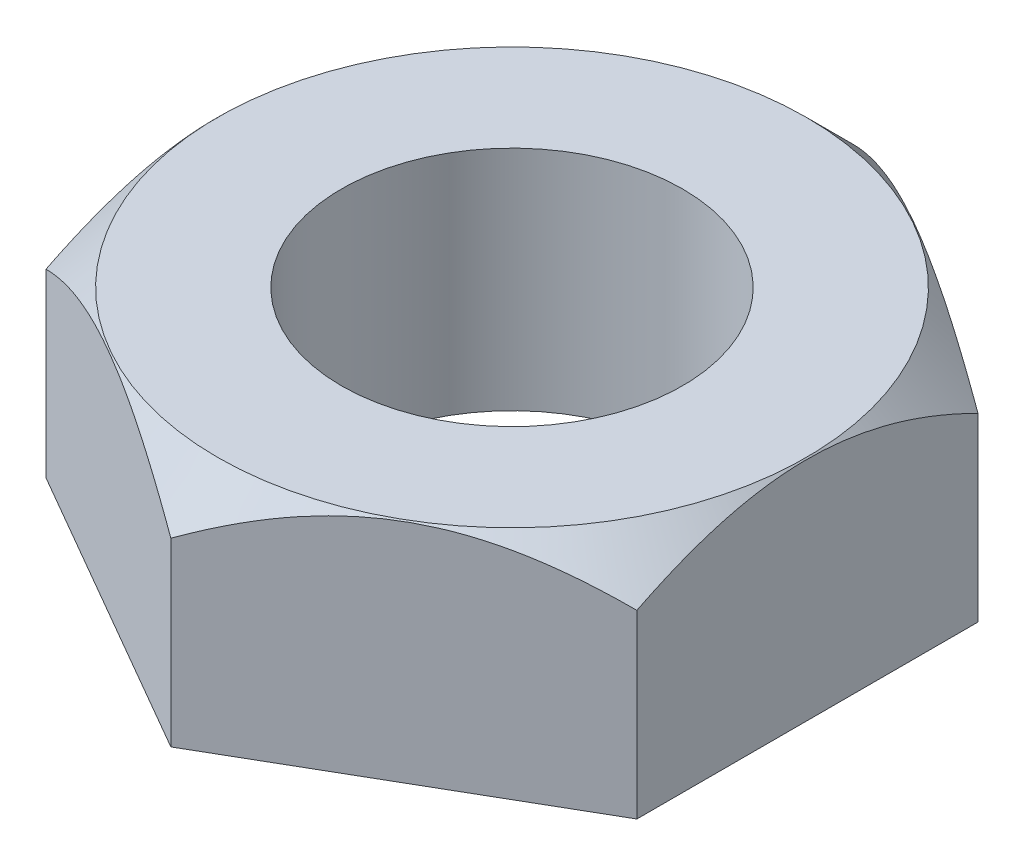
ISO-10303-21;
HEADER;
FILE_DESCRIPTION(('STEP AP214'),'2;1');
FILE_NAME('part.step','',(''),(''),'','','');
FILE_SCHEMA(('AUTOMOTIVE_DESIGN { 1 0 10303 214 1 1 1 1 }'));
ENDSEC;
DATA;
#1=APPLICATION_CONTEXT('core data for automotive mechanical design processes');
#2=APPLICATION_PROTOCOL_DEFINITION('international standard','automotive_design',2000,#1);
#3=PRODUCT_CONTEXT('',#1,'mechanical');
#4=PRODUCT('Part','Part','',(#3));
#5=PRODUCT_RELATED_PRODUCT_CATEGORY('part','',(#4));
#6=PRODUCT_DEFINITION_FORMATION('','',#4);
#7=PRODUCT_DEFINITION_CONTEXT('part definition',#1,'design');
#8=PRODUCT_DEFINITION('design','',#6,#7);
#9=PRODUCT_DEFINITION_SHAPE('','',#8);
#10=(LENGTH_UNIT() NAMED_UNIT(*) SI_UNIT(.MILLI.,.METRE.));
#11=(NAMED_UNIT(*) PLANE_ANGLE_UNIT() SI_UNIT($,.RADIAN.));
#12=(NAMED_UNIT(*) SI_UNIT($,.STERADIAN.) SOLID_ANGLE_UNIT());
#13=UNCERTAINTY_MEASURE_WITH_UNIT(LENGTH_MEASURE(1.E-05),#10,'distance_accuracy_value','');
#14=(GEOMETRIC_REPRESENTATION_CONTEXT(3) GLOBAL_UNCERTAINTY_ASSIGNED_CONTEXT((#13)) GLOBAL_UNIT_ASSIGNED_CONTEXT((#10,
#11,#12)) REPRESENTATION_CONTEXT('',''));
#15=CARTESIAN_POINT('',(0.,0.,0.));
#16=DIRECTION('',(0.,0.,1.));
#17=DIRECTION('',(1.,0.,0.));
#18=AXIS2_PLACEMENT_3D('',#15,#16,#17);
#19=CARTESIAN_POINT('',(0.,6.,0.));
#20=DIRECTION('',(0.,1.,0.));
#21=DIRECTION('',(0.,0.,1.));
#22=AXIS2_PLACEMENT_3D('',#19,#20,#21);
#23=PLANE('',#22);
#24=CARTESIAN_POINT('',(0.,6.,0.));
#25=DIRECTION('',(0.,1.,0.));
#26=DIRECTION('',(0.,0.,1.));
#27=AXIS2_PLACEMENT_3D('',#24,#25,#26);
#28=CIRCLE('',#27,4.5);
#29=CARTESIAN_POINT('',(0.,6.,4.5));
#30=VERTEX_POINT('',#29);
#31=EDGE_CURVE('E131',#30,#30,#28,.T.);
#32=ORIENTED_EDGE('',*,*,#31,.F.);
#33=EDGE_LOOP('',(#32));
#34=FACE_BOUND('',#33,.T.);
#35=CARTESIAN_POINT('',(0.,6.,0.));
#36=DIRECTION('',(0.,1.,0.));
#37=DIRECTION('',(0.,0.,1.));
#38=AXIS2_PLACEMENT_3D('',#35,#36,#37);
#39=CIRCLE('',#38,7.76833299123712);
#40=CARTESIAN_POINT('',(0.,6.,7.76833299123712));
#41=VERTEX_POINT('',#40);
#42=EDGE_CURVE('E198',#41,#41,#39,.T.);
#43=ORIENTED_EDGE('',*,*,#42,.T.);
#44=EDGE_LOOP('',(#43));
#45=FACE_BOUND('',#44,.T.);
#46=ADVANCED_FACE('F34',(#34,#45),#23,.T.);
#47=CARTESIAN_POINT('',(-7.79422863405995,6.,4.5));
#48=DIRECTION('',(0.5,0.,-0.866025403784439));
#49=DIRECTION('',(-0.866025403784439,0.,-0.5));
#50=AXIS2_PLACEMENT_3D('',#47,#48,#49);
#51=PLANE('',#50);
#52=CARTESIAN_POINT('',(-7.79442863405995,4.76821751896109,4.49988452994616));
#53=CARTESIAN_POINT('',(-7.66041372123064,4.84558242945827,4.57725807594359));
#54=CARTESIAN_POINT('',(-7.52536871384025,4.92057309594297,4.65522634731315));
#55=CARTESIAN_POINT('',(-7.25301642935903,5.06508371881172,4.81246901207279));
#56=CARTESIAN_POINT('',(-7.11570796554703,5.13460068740542,4.89174409061666));
#57=CARTESIAN_POINT('',(-6.69880871174527,5.33445049313076,5.13244098702406));
#58=CARTESIAN_POINT('',(-6.41568871917626,5.45522970219843,5.29590039094675));
#59=CARTESIAN_POINT('',(-5.84475465604816,5.66205562867578,5.62552932598328));
#60=CARTESIAN_POINT('',(-5.55708650309095,5.74862339554186,5.79161461153041));
#61=CARTESIAN_POINT('',(-5.12085504562915,5.84876092468195,6.04347296092496));
#62=CARTESIAN_POINT('',(-4.97480232445877,5.87717435672278,6.12779653880856));
#63=CARTESIAN_POINT('',(-4.68146027884235,5.92345356024511,6.29715764780983));
#64=CARTESIAN_POINT('',(-4.53417114252977,5.94132090794165,6.38219507030861));
#65=CARTESIAN_POINT('',(-4.17524511535322,5.97127824286066,6.58942110871815));
#66=CARTESIAN_POINT('',(-3.96322149182777,5.9775636745897,6.71183300483513));
#67=CARTESIAN_POINT('',(-3.53955641410975,5.96701271093291,6.95643615150187));
#68=CARTESIAN_POINT('',(-3.327915119914,5.95016821060436,7.07862730967743));
#69=CARTESIAN_POINT('',(-2.90662788254712,5.89435030217116,7.32185760957735));
#70=CARTESIAN_POINT('',(-2.69698443768143,5.85535214844893,7.4428953089044));
#71=CARTESIAN_POINT('',(-2.28130081777274,5.7573471123132,7.6828903587564));
#72=CARTESIAN_POINT('',(-2.07526036769794,5.69834176420626,7.80184786807104));
#73=CARTESIAN_POINT('',(-1.70950698787426,5.57695151866141,8.01301568036926));
#74=CARTESIAN_POINT('',(-1.54898406478078,5.51775953181947,8.10569363322838));
#75=CARTESIAN_POINT('',(-1.23081969847636,5.38983725305795,8.28938591576078));
#76=CARTESIAN_POINT('',(-1.07317834270549,5.32110667223531,8.38040019495051));
#77=CARTESIAN_POINT('',(-0.761273636312132,5.17564781796606,8.56047846114823));
#78=CARTESIAN_POINT('',(-0.607001415060563,5.0989446960026,8.6495475696163));
#79=CARTESIAN_POINT('',(-0.301313566118108,4.93854771618268,8.82603653149123));
#80=CARTESIAN_POINT('',(-0.149896255641077,4.85485814502749,8.91345735645511));
#81=CARTESIAN_POINT('',(0.000199999999998479,4.76821751896109,9.00011547005384));
#82=B_SPLINE_CURVE_WITH_KNOTS('',3,(#52,#53,#54,#55,#56,#57,#58,#59,#60,#61,#62,#63,#64,#65,#66,
#67,#68,#69,#70,#71,#72,#73,#74,#75,#76,#77,#78,#79,#80,#81),.UNSPECIFIED.,.F.,.F.,(4,2,2,2,2,2,
2,2,2,2,2,2,2,2,4),(0.,0.518995570787867,1.03827249662172,2.08243235310214,3.11001247476867,
3.62279481108642,4.13550048766922,4.86907230716035,5.60290124262733,6.33755148088632,
7.07214539321499,7.65560480846296,8.23908189927372,8.82077112592718,9.40210603032025),.UNSPECIFIED.);
#83=CARTESIAN_POINT('',(-7.79422863405995,4.76833299123712,4.5));
#84=VERTEX_POINT('',#83);
#85=CARTESIAN_POINT('',(0.,4.76833299123713,9.));
#86=VERTEX_POINT('',#85);
#87=EDGE_CURVE('E92',#84,#86,#82,.T.);
#88=ORIENTED_EDGE('',*,*,#87,.F.);
#89=DIRECTION('',(0.,-1.,0.));
#90=VECTOR('',#89,1.);
#91=CARTESIAN_POINT('',(-7.79422863405995,6.,4.5));
#92=LINE('',#91,#90);
#93=CARTESIAN_POINT('',(-7.79422863405995,0.,4.5));
#94=VERTEX_POINT('',#93);
#95=EDGE_CURVE('E62',#84,#94,#92,.T.);
#96=ORIENTED_EDGE('',*,*,#95,.T.);
#97=DIRECTION('',(0.866025403784439,0.,0.5));
#98=VECTOR('',#97,1.);
#99=CARTESIAN_POINT('',(-7.79422863405995,0.,4.5));
#100=LINE('',#99,#98);
#101=CARTESIAN_POINT('',(0.,0.,9.));
#102=VERTEX_POINT('',#101);
#103=EDGE_CURVE('E126',#94,#102,#100,.T.);
#104=ORIENTED_EDGE('',*,*,#103,.T.);
#105=DIRECTION('',(0.,-1.,0.));
#106=VECTOR('',#105,1.);
#107=CARTESIAN_POINT('',(0.,6.,9.));
#108=LINE('',#107,#106);
#109=EDGE_CURVE('E48',#86,#102,#108,.T.);
#110=ORIENTED_EDGE('',*,*,#109,.F.);
#111=EDGE_LOOP('',(#88,#96,#104,#110));
#112=FACE_BOUND('',#111,.T.);
#113=ADVANCED_FACE('F36',(#112),#51,.F.);
#114=CARTESIAN_POINT('',(0.,6.,9.));
#115=DIRECTION('',(-0.5,0.,-0.866025403784438));
#116=DIRECTION('',(-0.866025403784439,0.,0.5));
#117=AXIS2_PLACEMENT_3D('',#114,#115,#116);
#118=PLANE('',#117);
#119=CARTESIAN_POINT('',(-0.00020000000000095,4.7682175189611,9.00011547005384));
#120=CARTESIAN_POINT('',(0.133814912829307,4.84558242945827,8.92274192405642));
#121=CARTESIAN_POINT('',(0.268859920219699,4.92057309594297,8.84477365268686));
#122=CARTESIAN_POINT('',(0.54121220470092,5.06508371881173,8.68753098792721));
#123=CARTESIAN_POINT('',(0.678520668512919,5.13460068740542,8.60825590938334));
#124=CARTESIAN_POINT('',(1.09541992231468,5.33445049313076,8.36755901297595));
#125=CARTESIAN_POINT('',(1.37853991488369,5.45522970219843,8.20409960905326));
#126=CARTESIAN_POINT('',(1.94947397801179,5.66205562867578,7.87447067401673));
#127=CARTESIAN_POINT('',(2.23714213096899,5.74862339554186,7.7083853884696));
#128=CARTESIAN_POINT('',(2.67337358843079,5.84876092468195,7.45652703907505));
#129=CARTESIAN_POINT('',(2.81942630960118,5.87717435672278,7.37220346119145));
#130=CARTESIAN_POINT('',(3.1127683552176,5.92345356024511,7.20284235219017));
#131=CARTESIAN_POINT('',(3.26005749153018,5.94132090794165,7.1178049296914));
#132=CARTESIAN_POINT('',(3.61898351870673,5.97127824286066,6.91057889128185));
#133=CARTESIAN_POINT('',(3.83100714223218,5.9775636745897,6.78816699516488));
#134=CARTESIAN_POINT('',(4.2546722199502,5.96701271093291,6.54356384849813));
#135=CARTESIAN_POINT('',(4.46631351414594,5.95016821060436,6.42137269032258));
#136=CARTESIAN_POINT('',(4.88760075151283,5.89435030217116,6.17814239042265));
#137=CARTESIAN_POINT('',(5.09724419637851,5.85535214844893,6.05710469109561));
#138=CARTESIAN_POINT('',(5.5129278162872,5.75734711231321,5.81710964124361));
#139=CARTESIAN_POINT('',(5.71896826636201,5.69834176420627,5.69815213192897));
#140=CARTESIAN_POINT('',(6.08472164618569,5.57695151866141,5.48698431963075));
#141=CARTESIAN_POINT('',(6.24524456927916,5.51775953181947,5.39430636677163));
#142=CARTESIAN_POINT('',(6.56340893558359,5.38983725305795,5.21061408423922));
#143=CARTESIAN_POINT('',(6.72105029135446,5.32110667223531,5.11959980504949));
#144=CARTESIAN_POINT('',(7.03295499774782,5.17564781796606,4.93952153885177));
#145=CARTESIAN_POINT('',(7.18722721899938,5.09894469600261,4.8504524303837));
#146=CARTESIAN_POINT('',(7.49291506794184,4.93854771618268,4.67396346850877));
#147=CARTESIAN_POINT('',(7.64433237841887,4.85485814502749,4.58654264354489));
#148=CARTESIAN_POINT('',(7.79442863405995,4.7682175189611,4.49988452994616));
#149=B_SPLINE_CURVE_WITH_KNOTS('',3,(#119,#120,#121,#122,#123,#124,#125,#126,#127,#128,#129,
#130,#131,#132,#133,#134,#135,#136,#137,#138,#139,#140,#141,#142,#143,#144,#145,#146,#147,#148),
.UNSPECIFIED.,.F.,.F.,(4,2,2,2,2,2,2,2,2,2,2,2,2,2,4),(0.,0.518995570787867,1.03827249662172,
2.08243235310214,3.11001247476867,3.62279481108642,4.13550048766921,4.86907230716034,
5.60290124262733,6.33755148088632,7.07214539321498,7.65560480846296,8.23908189927372,
8.82077112592717,9.40210603032025),.UNSPECIFIED.);
#150=CARTESIAN_POINT('',(7.79422863405995,4.76833299123713,4.5));
#151=VERTEX_POINT('',#150);
#152=EDGE_CURVE('E98',#86,#151,#149,.T.);
#153=ORIENTED_EDGE('',*,*,#152,.F.);
#154=ORIENTED_EDGE('',*,*,#109,.T.);
#155=DIRECTION('',(0.866025403784439,0.,-0.5));
#156=VECTOR('',#155,1.);
#157=CARTESIAN_POINT('',(0.,0.,9.));
#158=LINE('',#157,#156);
#159=CARTESIAN_POINT('',(7.79422863405995,0.,4.5));
#160=VERTEX_POINT('',#159);
#161=EDGE_CURVE('E121',#102,#160,#158,.T.);
#162=ORIENTED_EDGE('',*,*,#161,.T.);
#163=DIRECTION('',(0.,-1.,0.));
#164=VECTOR('',#163,1.);
#165=CARTESIAN_POINT('',(7.79422863405995,6.,4.5));
#166=LINE('',#165,#164);
#167=EDGE_CURVE('E115',#151,#160,#166,.T.);
#168=ORIENTED_EDGE('',*,*,#167,.F.);
#169=EDGE_LOOP('',(#153,#154,#162,#168));
#170=FACE_BOUND('',#169,.T.);
#171=ADVANCED_FACE('F119',(#170),#118,.F.);
#172=CARTESIAN_POINT('',(7.79422863405995,6.,4.5));
#173=DIRECTION('',(-1.,0.,0.));
#174=DIRECTION('',(0.,0.,1.));
#175=AXIS2_PLACEMENT_3D('',#172,#173,#174);
#176=PLANE('',#175);
#177=CARTESIAN_POINT('',(7.79422863405995,1.00283372869386,-10.1097958150495));
#178=CARTESIAN_POINT('',(7.79422863405995,1.19423687132963,-9.868060894209));
#179=CARTESIAN_POINT('',(7.79422863405995,1.38412519086404,-9.6251085368683));
#180=CARTESIAN_POINT('',(7.79422863405995,1.76015808962681,-9.13624360138551));
#181=CARTESIAN_POINT('',(7.79422863405995,1.9463018571795,-8.89033039952412));
#182=CARTESIAN_POINT('',(7.79422863405995,2.31544716981755,-8.39323867699101));
#183=CARTESIAN_POINT('',(7.79422863405995,2.49841405234729,-8.14203433617656));
#184=CARTESIAN_POINT('',(7.79422863405995,2.85867088303918,-7.63560222417105));
#185=CARTESIAN_POINT('',(7.79422863405995,3.03596120992673,-7.38037472309763));
#186=CARTESIAN_POINT('',(7.79422863405995,3.3964709423575,-6.84597025144563));
#187=CARTESIAN_POINT('',(7.79422863405995,3.57914803964707,-6.56642563486822));
#188=CARTESIAN_POINT('',(7.79422863405995,3.9341853603516,-6.00074778326396));
#189=CARTESIAN_POINT('',(7.79422863405995,4.10654368115614,-5.71461334656924));
#190=CARTESIAN_POINT('',(7.79422863405995,4.43735836825441,-5.13550564882499));
#191=CARTESIAN_POINT('',(7.79422863405995,4.5958551854491,-4.84255567665185));
#192=CARTESIAN_POINT('',(7.79422863405995,4.89539575045497,-4.24793409222729));
#193=CARTESIAN_POINT('',(7.79422863405995,5.03644824235995,-3.94626694384362));
#194=CARTESIAN_POINT('',(7.79422863405995,5.27958858177105,-3.3716082374914));
#195=CARTESIAN_POINT('',(7.79422863405995,5.38434392269347,-3.09975672897118));
#196=CARTESIAN_POINT('',(7.79422863405995,5.57212607423086,-2.54850840255281));
#197=CARTESIAN_POINT('',(7.79422863405995,5.65515163259154,-2.26911115082808));
#198=CARTESIAN_POINT('',(7.79422863405995,5.79328963406325,-1.70970939459647));
#199=CARTESIAN_POINT('',(7.79422863405995,5.84896012832319,-1.42984518530938));
#200=CARTESIAN_POINT('',(7.79422863405995,5.93111444571807,-0.86584052829939));
#201=CARTESIAN_POINT('',(7.79422863405995,5.95760646432748,-0.581701304056924));
#202=CARTESIAN_POINT('',(7.79422863405995,5.97865697806164,-0.0288995921231431));
#203=CARTESIAN_POINT('',(7.79422863405995,5.9749941937257,0.239695104971063));
#204=CARTESIAN_POINT('',(7.79422863405995,5.9402190552775,0.775088374499679));
#205=CARTESIAN_POINT('',(7.79422863405995,5.90910455563614,1.04188680490191));
#206=CARTESIAN_POINT('',(7.79422863405995,5.82076017570773,1.5763175527999));
#207=CARTESIAN_POINT('',(7.79422863405995,5.76303953377883,1.84386721975144));
#208=CARTESIAN_POINT('',(7.79422863405995,5.62489872460832,2.37293336239268));
#209=CARTESIAN_POINT('',(7.79422863405995,5.54447871713807,2.63444988053319));
#210=CARTESIAN_POINT('',(7.79422863405995,5.36394793093902,3.15332600583502));
#211=CARTESIAN_POINT('',(7.79422863405995,5.26365529975056,3.4106214876158));
#212=CARTESIAN_POINT('',(7.79422863405995,5.04750175297162,3.9186457281129));
#213=CARTESIAN_POINT('',(7.79422863405995,4.93163409659663,4.169371587075));
#214=CARTESIAN_POINT('',(7.79422863405995,4.68707504554829,4.66539936601548));
#215=CARTESIAN_POINT('',(7.79422863405995,4.55834519238167,4.91068216692817));
#216=CARTESIAN_POINT('',(7.79422863405995,4.29088028086795,5.39564757698168));
#217=CARTESIAN_POINT('',(7.79422863405995,4.15214670711036,5.63533101012829));
#218=CARTESIAN_POINT('',(7.79422863405995,3.87365727003553,6.09811796807594));
#219=CARTESIAN_POINT('',(7.79422863405995,3.73428932888445,6.32145617445939));
#220=CARTESIAN_POINT('',(7.79422863405995,3.44956668432296,6.76429461216176));
#221=CARTESIAN_POINT('',(7.79422863405995,3.30421153934224,6.98379455869322));
#222=CARTESIAN_POINT('',(7.79422863405995,3.00974421962018,7.41771335152282));
#223=CARTESIAN_POINT('',(7.79422863405995,2.86067091369336,7.63215867051082));
#224=CARTESIAN_POINT('',(7.79422863405995,2.5584860783375,8.05809958448549));
#225=CARTESIAN_POINT('',(7.79422863405995,2.40537567229911,8.26959597553226));
#226=CARTESIAN_POINT('',(7.79422863405995,2.25061118781652,8.47985350940631));
#227=B_SPLINE_CURVE_WITH_KNOTS('',3,(#177,#178,#179,#180,#181,#182,#183,#184,#185,#186,#187,
#188,#189,#190,#191,#192,#193,#194,#195,#196,#197,#198,#199,#200,#201,#202,#203,#204,#205,#206,
#207,#208,#209,#210,#211,#212,#213,#214,#215,#216,#217,#218,#219,#220,#221,#222,#223,#224,#225,
#226),.UNSPECIFIED.,.F.,.F.,(4,2,2,2,2,2,2,2,2,2,2,2,2,2,2,2,2,2,2,2,2,2,2,2,4),(0.,
0.92502212321934,1.85024264109112,2.78249948240241,3.71469399574683,4.71633786379376,
5.71816585305563,6.7169652856119,7.71526201589044,8.58853815781755,9.46186461424317,
10.316547304928,11.1709898762205,11.9754098702433,12.7798927404609,13.5998480372156,
14.419797562791,15.2476291126683,16.0758201039862,16.9065660644547,17.7371889918511,
18.5268434140197,19.3165561796978,20.1000150023417,20.8832580685212),.UNSPECIFIED.);
#228=CARTESIAN_POINT('',(7.79422863405995,4.76833299123713,-4.5));
#229=VERTEX_POINT('',#228);
#230=EDGE_CURVE('E153',#151,#229,#227,.F.);
#231=ORIENTED_EDGE('',*,*,#230,.F.);
#232=ORIENTED_EDGE('',*,*,#167,.T.);
#233=DIRECTION('',(0.,0.,-1.));
#234=VECTOR('',#233,1.);
#235=CARTESIAN_POINT('',(7.79422863405995,0.,4.5));
#236=LINE('',#235,#234);
#237=CARTESIAN_POINT('',(7.79422863405995,0.,-4.5));
#238=VERTEX_POINT('',#237);
#239=EDGE_CURVE('E129',#160,#238,#236,.T.);
#240=ORIENTED_EDGE('',*,*,#239,.T.);
#241=DIRECTION('',(0.,-1.,0.));
#242=VECTOR('',#241,1.);
#243=CARTESIAN_POINT('',(7.79422863405995,6.,-4.5));
#244=LINE('',#243,#242);
#245=EDGE_CURVE('E113',#229,#238,#244,.T.);
#246=ORIENTED_EDGE('',*,*,#245,.F.);
#247=EDGE_LOOP('',(#231,#232,#240,#246));
#248=FACE_BOUND('',#247,.T.);
#249=ADVANCED_FACE('F152',(#248),#176,.F.);
#250=CARTESIAN_POINT('',(7.79422863405995,6.,-4.5));
#251=DIRECTION('',(-0.5,0.,0.866025403784439));
#252=DIRECTION('',(0.866025403784439,0.,0.5));
#253=AXIS2_PLACEMENT_3D('',#250,#251,#252);
#254=PLANE('',#253);
#255=CARTESIAN_POINT('',(7.79442863405995,4.7682175189611,-4.49988452994616));
#256=CARTESIAN_POINT('',(7.66041372123064,4.84558242945828,-4.57725807594359));
#257=CARTESIAN_POINT('',(7.52536871384025,4.92057309594297,-4.65522634731315));
#258=CARTESIAN_POINT('',(7.25301642935903,5.06508371881173,-4.81246901207279));
#259=CARTESIAN_POINT('',(7.11570796554703,5.13460068740542,-4.89174409061666));
#260=CARTESIAN_POINT('',(6.69880871174527,5.33445049313076,-5.13244098702406));
#261=CARTESIAN_POINT('',(6.41568871917625,5.45522970219844,-5.29590039094674));
#262=CARTESIAN_POINT('',(5.84475465604816,5.66205562867578,-5.62552932598328));
#263=CARTESIAN_POINT('',(5.55708650309095,5.74862339554186,-5.7916146115304));
#264=CARTESIAN_POINT('',(5.12085504562915,5.84876092468195,-6.04347296092496));
#265=CARTESIAN_POINT('',(4.97480232445876,5.87717435672278,-6.12779653880856));
#266=CARTESIAN_POINT('',(4.68146027884235,5.92345356024511,-6.29715764780983));
#267=CARTESIAN_POINT('',(4.53417114252977,5.94132090794165,-6.3821950703086));
#268=CARTESIAN_POINT('',(4.17524511535322,5.97127824286066,-6.58942110871815));
#269=CARTESIAN_POINT('',(3.96322149182777,5.9775636745897,-6.71183300483513));
#270=CARTESIAN_POINT('',(3.53955641410975,5.96701271093291,-6.95643615150187));
#271=CARTESIAN_POINT('',(3.327915119914,5.95016821060436,-7.07862730967743));
#272=CARTESIAN_POINT('',(2.90662788254712,5.89435030217117,-7.32185760957735));
#273=CARTESIAN_POINT('',(2.69698443768143,5.85535214844893,-7.44289530890439));
#274=CARTESIAN_POINT('',(2.28130081777274,5.75734711231321,-7.68289035875639));
#275=CARTESIAN_POINT('',(2.07526036769793,5.69834176420627,-7.80184786807103));
#276=CARTESIAN_POINT('',(1.70950698787425,5.57695151866141,-8.01301568036925));
#277=CARTESIAN_POINT('',(1.54898406478078,5.51775953181947,-8.10569363322838));
#278=CARTESIAN_POINT('',(1.23081969847636,5.38983725305795,-8.28938591576078));
#279=CARTESIAN_POINT('',(1.07317834270549,5.32110667223531,-8.38040019495051));
#280=CARTESIAN_POINT('',(0.761273636312129,5.17564781796607,-8.56047846114823));
#281=CARTESIAN_POINT('',(0.607001415060562,5.09894469600261,-8.6495475696163));
#282=CARTESIAN_POINT('',(0.301313566118107,4.93854771618268,-8.82603653149122));
#283=CARTESIAN_POINT('',(0.149896255641077,4.8548581450275,-8.91345735645511));
#284=CARTESIAN_POINT('',(-0.000199999999999437,4.7682175189611,-9.00011547005384));
#285=B_SPLINE_CURVE_WITH_KNOTS('',3,(#255,#256,#257,#258,#259,#260,#261,#262,#263,#264,#265,
#266,#267,#268,#269,#270,#271,#272,#273,#274,#275,#276,#277,#278,#279,#280,#281,#282,#283,#284),
.UNSPECIFIED.,.F.,.F.,(4,2,2,2,2,2,2,2,2,2,2,2,2,2,4),(0.,0.518995570787869,1.03827249662172,
2.08243235310214,3.11001247476867,3.62279481108642,4.13550048766922,4.86907230716035,
5.60290124262733,6.33755148088632,7.07214539321498,7.65560480846296,8.23908189927372,
8.82077112592717,9.40210603032024),.UNSPECIFIED.);
#286=CARTESIAN_POINT('',(0.,4.76833299123713,-9.));
#287=VERTEX_POINT('',#286);
#288=EDGE_CURVE('E149',#229,#287,#285,.T.);
#289=ORIENTED_EDGE('',*,*,#288,.F.);
#290=ORIENTED_EDGE('',*,*,#245,.T.);
#291=DIRECTION('',(-0.866025403784439,0.,-0.5));
#292=VECTOR('',#291,1.);
#293=CARTESIAN_POINT('',(7.79422863405995,0.,-4.5));
#294=LINE('',#293,#292);
#295=CARTESIAN_POINT('',(0.,0.,-9.));
#296=VERTEX_POINT('',#295);
#297=EDGE_CURVE('E138',#238,#296,#294,.T.);
#298=ORIENTED_EDGE('',*,*,#297,.T.);
#299=DIRECTION('',(0.,-1.,0.));
#300=VECTOR('',#299,1.);
#301=CARTESIAN_POINT('',(0.,6.,-9.));
#302=LINE('',#301,#300);
#303=EDGE_CURVE('E106',#287,#296,#302,.T.);
#304=ORIENTED_EDGE('',*,*,#303,.F.);
#305=EDGE_LOOP('',(#289,#290,#298,#304));
#306=FACE_BOUND('',#305,.T.);
#307=ADVANCED_FACE('F147',(#306),#254,.F.);
#308=CARTESIAN_POINT('',(0.,6.,-9.));
#309=DIRECTION('',(0.5,0.,0.866025403784438));
#310=DIRECTION('',(0.866025403784439,0.,-0.5));
#311=AXIS2_PLACEMENT_3D('',#308,#309,#310);
#312=PLANE('',#311);
#313=CARTESIAN_POINT('',(0.000200000000000088,4.7682175189611,-9.00011547005384));
#314=CARTESIAN_POINT('',(-0.133814912829307,4.84558242945828,-8.92274192405641));
#315=CARTESIAN_POINT('',(-0.268859920219699,4.92057309594297,-8.84477365268685));
#316=CARTESIAN_POINT('',(-0.54121220470092,5.06508371881173,-8.68753098792721));
#317=CARTESIAN_POINT('',(-0.67852066851292,5.13460068740542,-8.60825590938334));
#318=CARTESIAN_POINT('',(-1.09541992231468,5.33445049313076,-8.36755901297594));
#319=CARTESIAN_POINT('',(-1.37853991488369,5.45522970219844,-8.20409960905326));
#320=CARTESIAN_POINT('',(-1.94947397801179,5.66205562867578,-7.87447067401672));
#321=CARTESIAN_POINT('',(-2.237142130969,5.74862339554187,-7.7083853884696));
#322=CARTESIAN_POINT('',(-2.6733735884308,5.84876092468195,-7.45652703907504));
#323=CARTESIAN_POINT('',(-2.81942630960118,5.87717435672278,-7.37220346119144));
#324=CARTESIAN_POINT('',(-3.1127683552176,5.92345356024511,-7.20284235219017));
#325=CARTESIAN_POINT('',(-3.26005749153018,5.94132090794165,-7.11780492969139));
#326=CARTESIAN_POINT('',(-3.61898351870673,5.97127824286066,-6.91057889128185));
#327=CARTESIAN_POINT('',(-3.83100714223218,5.9775636745897,-6.78816699516487));
#328=CARTESIAN_POINT('',(-4.2546722199502,5.96701271093291,-6.54356384849813));
#329=CARTESIAN_POINT('',(-4.46631351414595,5.95016821060436,-6.42137269032257));
#330=CARTESIAN_POINT('',(-4.88760075151283,5.89435030217117,-6.17814239042265));
#331=CARTESIAN_POINT('',(-5.09724419637852,5.85535214844893,-6.0571046910956));
#332=CARTESIAN_POINT('',(-5.51292781628721,5.75734711231321,-5.8171096412436));
#333=CARTESIAN_POINT('',(-5.71896826636201,5.69834176420627,-5.69815213192896));
#334=CARTESIAN_POINT('',(-6.08472164618569,5.57695151866142,-5.48698431963074));
#335=CARTESIAN_POINT('',(-6.24524456927917,5.51775953181947,-5.39430636677162));
#336=CARTESIAN_POINT('',(-6.56340893558359,5.38983725305795,-5.21061408423922));
#337=CARTESIAN_POINT('',(-6.72105029135446,5.32110667223531,-5.11959980504948));
#338=CARTESIAN_POINT('',(-7.03295499774782,5.17564781796606,-4.93952153885177));
#339=CARTESIAN_POINT('',(-7.18722721899939,5.09894469600261,-4.85045243038369));
#340=CARTESIAN_POINT('',(-7.49291506794185,4.93854771618268,-4.67396346850877));
#341=CARTESIAN_POINT('',(-7.64433237841888,4.85485814502749,-4.58654264354489));
#342=CARTESIAN_POINT('',(-7.79442863405995,4.7682175189611,-4.49988452994616));
#343=B_SPLINE_CURVE_WITH_KNOTS('',3,(#313,#314,#315,#316,#317,#318,#319,#320,#321,#322,#323,
#324,#325,#326,#327,#328,#329,#330,#331,#332,#333,#334,#335,#336,#337,#338,#339,#340,#341,#342),
.UNSPECIFIED.,.F.,.F.,(4,2,2,2,2,2,2,2,2,2,2,2,2,2,4),(0.,0.518995570787868,1.03827249662172,
2.08243235310214,3.11001247476867,3.62279481108642,4.13550048766922,4.86907230716035,
5.60290124262733,6.33755148088632,7.07214539321499,7.65560480846297,8.23908189927373,
8.82077112592718,9.40210603032025),.UNSPECIFIED.);
#344=CARTESIAN_POINT('',(-7.79422863405995,4.76833299123713,-4.49999999999999));
#345=VERTEX_POINT('',#344);
#346=EDGE_CURVE('E54',#287,#345,#343,.T.);
#347=ORIENTED_EDGE('',*,*,#346,.F.);
#348=ORIENTED_EDGE('',*,*,#303,.T.);
#349=DIRECTION('',(-0.866025403784439,0.,0.5));
#350=VECTOR('',#349,1.);
#351=CARTESIAN_POINT('',(0.,0.,-9.));
#352=LINE('',#351,#350);
#353=CARTESIAN_POINT('',(-7.79422863405995,0.,-4.49999999999999));
#354=VERTEX_POINT('',#353);
#355=EDGE_CURVE('E108',#296,#354,#352,.T.);
#356=ORIENTED_EDGE('',*,*,#355,.T.);
#357=DIRECTION('',(0.,-1.,0.));
#358=VECTOR('',#357,1.);
#359=CARTESIAN_POINT('',(-7.79422863405995,6.,-4.49999999999999));
#360=LINE('',#359,#358);
#361=EDGE_CURVE('E104',#345,#354,#360,.T.);
#362=ORIENTED_EDGE('',*,*,#361,.F.);
#363=EDGE_LOOP('',(#347,#348,#356,#362));
#364=FACE_BOUND('',#363,.T.);
#365=ADVANCED_FACE('F143',(#364),#312,.F.);
#366=CARTESIAN_POINT('',(-7.79422863405995,6.,-4.49999999999999));
#367=DIRECTION('',(1.,0.,0.));
#368=DIRECTION('',(0.,0.,-1.));
#369=AXIS2_PLACEMENT_3D('',#366,#367,#368);
#370=PLANE('',#369);
#371=CARTESIAN_POINT('',(-7.79422863405995,1.00283372477987,-10.1097958199917));
#372=CARTESIAN_POINT('',(-7.79422863405995,1.19423686756789,-9.86806089900288));
#373=CARTESIAN_POINT('',(-7.79422863405995,1.38412518725436,-9.62510854151352));
#374=CARTESIAN_POINT('',(-7.79422863405995,1.76015808632041,-9.13624360573215));
#375=CARTESIAN_POINT('',(-7.79422863405995,1.94630185402432,-8.89033040372083));
#376=CARTESIAN_POINT('',(-7.79422863405995,2.31544716696607,-8.39323868088315));
#377=CARTESIAN_POINT('',(-7.79422863405995,2.49841404964822,-8.14203433991401));
#378=CARTESIAN_POINT('',(-7.79422863405995,2.85867088064272,-7.63560222759668));
#379=CARTESIAN_POINT('',(-7.79422863405995,3.03596120768047,-7.38037472636613));
#380=CARTESIAN_POINT('',(-7.79422863405995,3.39647094042643,-6.84597025437404));
#381=CARTESIAN_POINT('',(-7.79422863405995,3.57914803788042,-6.56642563761321));
#382=CARTESIAN_POINT('',(-7.79422863405995,3.93418535890676,-6.00074778563583));
#383=CARTESIAN_POINT('',(-7.79422863405995,4.10654367986868,-5.7146133487514));
#384=CARTESIAN_POINT('',(-7.79422863405995,4.4373583672692,-5.13550565062105));
#385=CARTESIAN_POINT('',(-7.79422863405995,4.59585518460885,-4.84255567825158));
#386=CARTESIAN_POINT('',(-7.79422863405995,4.89539574988678,-4.24793409342344));
#387=CARTESIAN_POINT('',(-7.79422863405995,5.03644824191886,-3.94626694483254));
#388=CARTESIAN_POINT('',(-7.79422863405995,5.27958858140801,-3.37160823839622));
#389=CARTESIAN_POINT('',(-7.79422863405995,5.3843439223052,-3.09975673000949));
#390=CARTESIAN_POINT('',(-7.79422863405995,5.5721260738186,-2.54850840386438));
#391=CARTESIAN_POINT('',(-7.79422863405995,5.65515163218052,-2.26911115227943));
#392=CARTESIAN_POINT('',(-7.79422863405995,5.79328963368819,-1.70970939632355));
#393=CARTESIAN_POINT('',(-7.79422863405995,5.84896012798177,-1.42984518717226));
#394=CARTESIAN_POINT('',(-7.79422863405995,5.93111444547744,-0.865840530431439));
#395=CARTESIAN_POINT('',(-7.79422863405995,5.95760646415397,-0.581701306322346));
#396=CARTESIAN_POINT('',(-7.79422863405995,5.9786569780498,-0.0288995945915546));
#397=CARTESIAN_POINT('',(-7.79422863405995,5.97499419380176,0.239695102432725));
#398=CARTESIAN_POINT('',(-7.79422863405995,5.94021905553966,0.775088371831341));
#399=CARTESIAN_POINT('',(-7.79422863405995,5.90910455599654,1.0418868021735));
#400=CARTESIAN_POINT('',(-7.79422863405995,5.8207601762708,1.57631754995304));
#401=CARTESIAN_POINT('',(-7.79422863405995,5.76303953444704,1.84386721684649));
#402=CARTESIAN_POINT('',(-7.79422863405995,5.62489872548556,2.37293335937916));
#403=CARTESIAN_POINT('',(-7.79422863405995,5.5444787181192,2.63444987746919));
#404=CARTESIAN_POINT('',(-7.79422863405995,5.36394793220908,3.15332600243127));
#405=CARTESIAN_POINT('',(-7.79422863405995,5.2636553012235,3.41062148392912));
#406=CARTESIAN_POINT('',(-7.79422863405995,5.04750175487062,3.91864572387472));
#407=CARTESIAN_POINT('',(-7.79422863405995,4.93163409871882,4.16937158256827));
#408=CARTESIAN_POINT('',(-7.79422863405995,4.6870750481304,4.66539936098133));
#409=CARTESIAN_POINT('',(-7.79422863405995,4.55834519520062,4.9106821616352));
#410=CARTESIAN_POINT('',(-7.79422863405995,4.29088028416804,5.39564757117961));
#411=CARTESIAN_POINT('',(-7.79422863405995,4.15214671065475,5.63533100407592));
#412=CARTESIAN_POINT('',(-7.79422863405995,3.87365727404309,6.09811796157058));
#413=CARTESIAN_POINT('',(-7.79422863405995,3.7342893331097,6.32145616775048));
#414=CARTESIAN_POINT('',(-7.79422863405995,3.4495666889845,6.76429460504869));
#415=CARTESIAN_POINT('',(-7.79422863405995,3.30421154422237,6.98379455137953));
#416=CARTESIAN_POINT('',(-7.79422863405995,3.00974422493498,7.4177133438128));
#417=CARTESIAN_POINT('',(-7.79422863405995,2.86067091922423,7.63215866260506));
#418=CARTESIAN_POINT('',(-7.79422863405995,2.55848608430019,8.05809957618954));
#419=CARTESIAN_POINT('',(-7.79422863405995,2.40537567847756,8.26959596704187));
#420=CARTESIAN_POINT('',(-7.79422863405995,2.25061119421043,8.47985350072182));
#421=B_SPLINE_CURVE_WITH_KNOTS('',3,(#371,#372,#373,#374,#375,#376,#377,#378,#379,#380,#381,
#382,#383,#384,#385,#386,#387,#388,#389,#390,#391,#392,#393,#394,#395,#396,#397,#398,#399,#400,
#401,#402,#403,#404,#405,#406,#407,#408,#409,#410,#411,#412,#413,#414,#415,#416,#417,#418,#419,
#420),.UNSPECIFIED.,.F.,.F.,(4,2,2,2,2,2,2,2,2,2,2,2,2,2,2,2,2,2,2,2,2,2,2,2,4),(0.,
0.92502212385161,1.85024264235584,2.78249948431143,3.71469399830004,4.71633786707734,
5.71816585707006,6.71696529035086,7.71526202135264,8.58853816288028,9.46186461890711,
10.3165473092146,11.1709898801302,11.9754098739407,12.7798927439455,13.5998480404633,
14.419797565802,15.2476291146688,16.075820104975,16.9065660644261,17.7371889908055,
18.5268434121102,19.3165561769244,20.1000149987161,20.8832580640435),.UNSPECIFIED.);
#422=EDGE_CURVE('E12',#345,#84,#421,.T.);
#423=ORIENTED_EDGE('',*,*,#422,.F.);
#424=ORIENTED_EDGE('',*,*,#361,.T.);
#425=DIRECTION('',(0.,0.,1.));
#426=VECTOR('',#425,1.);
#427=CARTESIAN_POINT('',(-7.79422863405995,0.,-4.49999999999999));
#428=LINE('',#427,#426);
#429=EDGE_CURVE('E102',#354,#94,#428,.T.);
#430=ORIENTED_EDGE('',*,*,#429,.T.);
#431=ORIENTED_EDGE('',*,*,#95,.F.);
#432=EDGE_LOOP('',(#423,#424,#430,#431));
#433=FACE_BOUND('',#432,.T.);
#434=ADVANCED_FACE('F100',(#433),#370,.F.);
#435=CARTESIAN_POINT('',(0.,0.,0.));
#436=DIRECTION('',(0.,1.,0.));
#437=DIRECTION('',(0.,0.,1.));
#438=AXIS2_PLACEMENT_3D('',#435,#436,#437);
#439=PLANE('',#438);
#440=ORIENTED_EDGE('',*,*,#103,.F.);
#441=ORIENTED_EDGE('',*,*,#429,.F.);
#442=ORIENTED_EDGE('',*,*,#355,.F.);
#443=ORIENTED_EDGE('',*,*,#297,.F.);
#444=ORIENTED_EDGE('',*,*,#239,.F.);
#445=ORIENTED_EDGE('',*,*,#161,.F.);
#446=EDGE_LOOP('',(#440,#441,#442,#443,#444,#445));
#447=FACE_BOUND('',#446,.T.);
#448=CARTESIAN_POINT('',(0.,0.,0.));
#449=DIRECTION('',(0.,1.,0.));
#450=DIRECTION('',(0.,0.,1.));
#451=AXIS2_PLACEMENT_3D('',#448,#449,#450);
#452=CIRCLE('',#451,4.5);
#453=CARTESIAN_POINT('',(0.,0.,4.5));
#454=VERTEX_POINT('',#453);
#455=EDGE_CURVE('E97',#454,#454,#452,.T.);
#456=ORIENTED_EDGE('',*,*,#455,.T.);
#457=EDGE_LOOP('',(#456));
#458=FACE_BOUND('',#457,.T.);
#459=ADVANCED_FACE('F124',(#447,#458),#439,.F.);
#460=CARTESIAN_POINT('',(0.,6.,0.));
#461=DIRECTION('',(0.,-1.,0.));
#462=DIRECTION('',(0.,0.,-1.));
#463=AXIS2_PLACEMENT_3D('',#460,#461,#462);
#464=CYLINDRICAL_SURFACE('',#463,4.5);
#465=ORIENTED_EDGE('',*,*,#31,.T.);
#466=EDGE_LOOP('',(#465));
#467=FACE_BOUND('',#466,.T.);
#468=ORIENTED_EDGE('',*,*,#455,.F.);
#469=EDGE_LOOP('',(#468));
#470=FACE_BOUND('',#469,.T.);
#471=ADVANCED_FACE('F188',(#467,#470),#464,.F.);
#472=CARTESIAN_POINT('',(0.,6.,0.));
#473=DIRECTION('',(0.,-1.,0.));
#474=DIRECTION('',(0.,0.,1.));
#475=AXIS2_PLACEMENT_3D('',#472,#473,#474);
#476=CONICAL_SURFACE('',#475,7.76833299123712,0.78539816339745);
#477=ORIENTED_EDGE('',*,*,#42,.F.);
#478=EDGE_LOOP('',(#477));
#479=FACE_BOUND('',#478,.T.);
#480=ORIENTED_EDGE('',*,*,#87,.T.);
#481=ORIENTED_EDGE('',*,*,#152,.T.);
#482=ORIENTED_EDGE('',*,*,#230,.T.);
#483=ORIENTED_EDGE('',*,*,#288,.T.);
#484=ORIENTED_EDGE('',*,*,#346,.T.);
#485=ORIENTED_EDGE('',*,*,#422,.T.);
#486=EDGE_LOOP('',(#480,#481,#482,#483,#484,#485));
#487=FACE_BOUND('',#486,.T.);
#488=ADVANCED_FACE('F91',(#479,#487),#476,.T.);
#489=CLOSED_SHELL('',(#46,#113,#171,#249,#307,#365,#434,#459,#471,#488));
#490=MANIFOLD_SOLID_BREP('B2',#489);
#491=ADVANCED_BREP_SHAPE_REPRESENTATION('',(#18,#490),#14);
#492=SHAPE_DEFINITION_REPRESENTATION(#9,#491);
ENDSEC;
END-ISO-10303-21;
